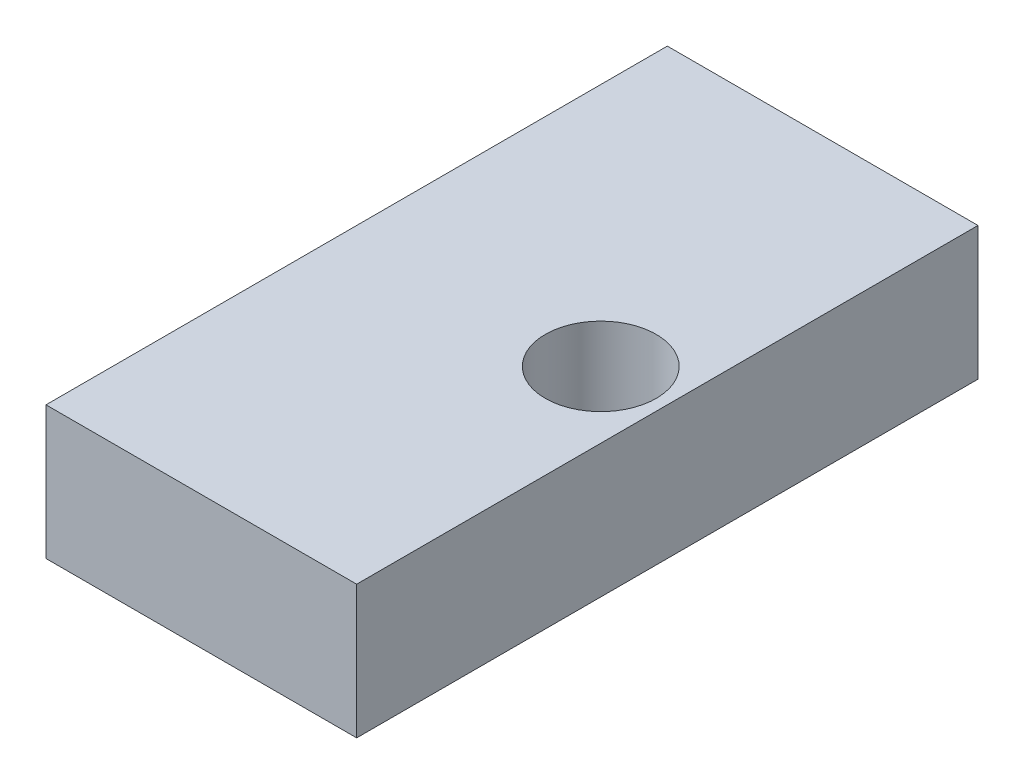
ISO-10303-21;
HEADER;
FILE_DESCRIPTION(('STEP AP214'),'2;1');
FILE_NAME('part.step','',(''),(''),'','','');
FILE_SCHEMA(('AUTOMOTIVE_DESIGN { 1 0 10303 214 1 1 1 1 }'));
ENDSEC;
DATA;
#1=APPLICATION_CONTEXT('core data for automotive mechanical design processes');
#2=APPLICATION_PROTOCOL_DEFINITION('international standard','automotive_design',2000,#1);
#3=PRODUCT_CONTEXT('',#1,'mechanical');
#4=PRODUCT('Part','Part','',(#3));
#5=PRODUCT_RELATED_PRODUCT_CATEGORY('part','',(#4));
#6=PRODUCT_DEFINITION_FORMATION('','',#4);
#7=PRODUCT_DEFINITION_CONTEXT('part definition',#1,'design');
#8=PRODUCT_DEFINITION('design','',#6,#7);
#9=PRODUCT_DEFINITION_SHAPE('','',#8);
#10=(LENGTH_UNIT() NAMED_UNIT(*) SI_UNIT(.MILLI.,.METRE.));
#11=(NAMED_UNIT(*) PLANE_ANGLE_UNIT() SI_UNIT($,.RADIAN.));
#12=(NAMED_UNIT(*) SI_UNIT($,.STERADIAN.) SOLID_ANGLE_UNIT());
#13=UNCERTAINTY_MEASURE_WITH_UNIT(LENGTH_MEASURE(1.E-05),#10,'distance_accuracy_value','');
#14=(GEOMETRIC_REPRESENTATION_CONTEXT(3) GLOBAL_UNCERTAINTY_ASSIGNED_CONTEXT((#13)) GLOBAL_UNIT_ASSIGNED_CONTEXT((#10,
#11,#12)) REPRESENTATION_CONTEXT('',''));
#15=CARTESIAN_POINT('',(0.,0.,0.));
#16=DIRECTION('',(0.,0.,1.));
#17=DIRECTION('',(1.,0.,0.));
#18=AXIS2_PLACEMENT_3D('',#15,#16,#17);
#19=CARTESIAN_POINT('',(22.225,9.525,-88.9));
#20=DIRECTION('',(1.,0.,0.));
#21=DIRECTION('',(0.,1.,0.));
#22=AXIS2_PLACEMENT_3D('',#19,#20,#21);
#23=PLANE('',#22);
#24=DIRECTION('',(0.,1.,0.));
#25=VECTOR('',#24,1.);
#26=CARTESIAN_POINT('',(22.225,9.525,0.));
#27=LINE('',#26,#25);
#28=CARTESIAN_POINT('',(22.225,-9.525,0.));
#29=VERTEX_POINT('',#28);
#30=CARTESIAN_POINT('',(22.225,9.525,0.));
#31=VERTEX_POINT('',#30);
#32=EDGE_CURVE('E98',#29,#31,#27,.T.);
#33=ORIENTED_EDGE('',*,*,#32,.F.);
#34=DIRECTION('',(0.,0.,1.));
#35=VECTOR('',#34,1.);
#36=CARTESIAN_POINT('',(22.225,-9.525,-88.9));
#37=LINE('',#36,#35);
#38=CARTESIAN_POINT('',(22.225,-9.525,-88.9));
#39=VERTEX_POINT('',#38);
#40=EDGE_CURVE('E11',#39,#29,#37,.T.);
#41=ORIENTED_EDGE('',*,*,#40,.F.);
#42=DIRECTION('',(0.,1.,0.));
#43=VECTOR('',#42,1.);
#44=CARTESIAN_POINT('',(22.225,9.525,-88.9));
#45=LINE('',#44,#43);
#46=CARTESIAN_POINT('',(22.225,9.525,-88.9));
#47=VERTEX_POINT('',#46);
#48=EDGE_CURVE('E91',#39,#47,#45,.T.);
#49=ORIENTED_EDGE('',*,*,#48,.T.);
#50=DIRECTION('',(0.,0.,1.));
#51=VECTOR('',#50,1.);
#52=CARTESIAN_POINT('',(22.225,9.525,-88.9));
#53=LINE('',#52,#51);
#54=EDGE_CURVE('E36',#47,#31,#53,.T.);
#55=ORIENTED_EDGE('',*,*,#54,.T.);
#56=EDGE_LOOP('',(#33,#41,#49,#55));
#57=FACE_BOUND('',#56,.T.);
#58=ADVANCED_FACE('F33',(#57),#23,.T.);
#59=CARTESIAN_POINT('',(-22.225,-9.525,-88.9));
#60=DIRECTION('',(0.,-1.,0.));
#61=DIRECTION('',(0.,0.,-1.));
#62=AXIS2_PLACEMENT_3D('',#59,#60,#61);
#63=PLANE('',#62);
#64=CARTESIAN_POINT('',(12.7000000000001,-9.525,-44.4499999999999));
#65=DIRECTION('',(0.,1.,0.));
#66=DIRECTION('',(0.,0.,1.));
#67=AXIS2_PLACEMENT_3D('',#64,#65,#66);
#68=CIRCLE('',#67,7.9375);
#69=CARTESIAN_POINT('',(12.7000000000001,-9.525,-36.5124999999999));
#70=VERTEX_POINT('',#69);
#71=EDGE_CURVE('E102',#70,#70,#68,.T.);
#72=ORIENTED_EDGE('',*,*,#71,.T.);
#73=EDGE_LOOP('',(#72));
#74=FACE_BOUND('',#73,.T.);
#75=DIRECTION('',(1.,0.,0.));
#76=VECTOR('',#75,1.);
#77=CARTESIAN_POINT('',(-22.225,-9.525,0.));
#78=LINE('',#77,#76);
#79=CARTESIAN_POINT('',(-22.225,-9.525,0.));
#80=VERTEX_POINT('',#79);
#81=EDGE_CURVE('E93',#80,#29,#78,.T.);
#82=ORIENTED_EDGE('',*,*,#81,.F.);
#83=DIRECTION('',(0.,0.,1.));
#84=VECTOR('',#83,1.);
#85=CARTESIAN_POINT('',(-22.225,-9.525,-88.9));
#86=LINE('',#85,#84);
#87=CARTESIAN_POINT('',(-22.225,-9.525,-88.9));
#88=VERTEX_POINT('',#87);
#89=EDGE_CURVE('E42',#88,#80,#86,.T.);
#90=ORIENTED_EDGE('',*,*,#89,.F.);
#91=DIRECTION('',(1.,0.,0.));
#92=VECTOR('',#91,1.);
#93=CARTESIAN_POINT('',(-22.225,-9.525,-88.9));
#94=LINE('',#93,#92);
#95=EDGE_CURVE('E88',#88,#39,#94,.T.);
#96=ORIENTED_EDGE('',*,*,#95,.T.);
#97=ORIENTED_EDGE('',*,*,#40,.T.);
#98=EDGE_LOOP('',(#82,#90,#96,#97));
#99=FACE_BOUND('',#98,.T.);
#100=ADVANCED_FACE('F109',(#74,#99),#63,.T.);
#101=CARTESIAN_POINT('',(-22.225,9.525,-88.9));
#102=DIRECTION('',(-1.,0.,0.));
#103=DIRECTION('',(0.,0.,1.));
#104=AXIS2_PLACEMENT_3D('',#101,#102,#103);
#105=PLANE('',#104);
#106=DIRECTION('',(0.,-1.,0.));
#107=VECTOR('',#106,1.);
#108=CARTESIAN_POINT('',(-22.225,9.525,0.));
#109=LINE('',#108,#107);
#110=CARTESIAN_POINT('',(-22.225,9.525,0.));
#111=VERTEX_POINT('',#110);
#112=EDGE_CURVE('E83',#111,#80,#109,.T.);
#113=ORIENTED_EDGE('',*,*,#112,.F.);
#114=DIRECTION('',(0.,0.,1.));
#115=VECTOR('',#114,1.);
#116=CARTESIAN_POINT('',(-22.225,9.525,-88.9));
#117=LINE('',#116,#115);
#118=CARTESIAN_POINT('',(-22.225,9.525,-88.9));
#119=VERTEX_POINT('',#118);
#120=EDGE_CURVE('E78',#119,#111,#117,.T.);
#121=ORIENTED_EDGE('',*,*,#120,.F.);
#122=DIRECTION('',(0.,-1.,0.));
#123=VECTOR('',#122,1.);
#124=CARTESIAN_POINT('',(-22.225,9.525,-88.9));
#125=LINE('',#124,#123);
#126=EDGE_CURVE('E81',#119,#88,#125,.T.);
#127=ORIENTED_EDGE('',*,*,#126,.T.);
#128=ORIENTED_EDGE('',*,*,#89,.T.);
#129=EDGE_LOOP('',(#113,#121,#127,#128));
#130=FACE_BOUND('',#129,.T.);
#131=ADVANCED_FACE('F80',(#130),#105,.T.);
#132=CARTESIAN_POINT('',(-22.225,9.525,-88.9));
#133=DIRECTION('',(0.,1.,0.));
#134=DIRECTION('',(0.,0.,1.));
#135=AXIS2_PLACEMENT_3D('',#132,#133,#134);
#136=PLANE('',#135);
#137=CARTESIAN_POINT('',(12.7000000000001,9.525,-44.4499999999999));
#138=DIRECTION('',(0.,1.,0.));
#139=DIRECTION('',(0.,0.,1.));
#140=AXIS2_PLACEMENT_3D('',#137,#138,#139);
#141=CIRCLE('',#140,7.9375);
#142=CARTESIAN_POINT('',(12.7000000000001,9.525,-36.5124999999999));
#143=VERTEX_POINT('',#142);
#144=EDGE_CURVE('E130',#143,#143,#141,.T.);
#145=ORIENTED_EDGE('',*,*,#144,.F.);
#146=EDGE_LOOP('',(#145));
#147=FACE_BOUND('',#146,.T.);
#148=DIRECTION('',(-1.,0.,0.));
#149=VECTOR('',#148,1.);
#150=CARTESIAN_POINT('',(-22.225,9.525,0.));
#151=LINE('',#150,#149);
#152=EDGE_CURVE('E101',#31,#111,#151,.T.);
#153=ORIENTED_EDGE('',*,*,#152,.F.);
#154=ORIENTED_EDGE('',*,*,#54,.F.);
#155=DIRECTION('',(-1.,0.,0.));
#156=VECTOR('',#155,1.);
#157=CARTESIAN_POINT('',(-22.225,9.525,-88.9));
#158=LINE('',#157,#156);
#159=EDGE_CURVE('E87',#47,#119,#158,.T.);
#160=ORIENTED_EDGE('',*,*,#159,.T.);
#161=ORIENTED_EDGE('',*,*,#120,.T.);
#162=EDGE_LOOP('',(#153,#154,#160,#161));
#163=FACE_BOUND('',#162,.T.);
#164=ADVANCED_FACE('F90',(#147,#163),#136,.T.);
#165=CARTESIAN_POINT('',(0.,0.,-88.9));
#166=DIRECTION('',(0.,0.,1.));
#167=DIRECTION('',(1.,0.,0.));
#168=AXIS2_PLACEMENT_3D('',#165,#166,#167);
#169=PLANE('',#168);
#170=ORIENTED_EDGE('',*,*,#48,.F.);
#171=ORIENTED_EDGE('',*,*,#95,.F.);
#172=ORIENTED_EDGE('',*,*,#126,.F.);
#173=ORIENTED_EDGE('',*,*,#159,.F.);
#174=EDGE_LOOP('',(#170,#171,#172,#173));
#175=FACE_BOUND('',#174,.T.);
#176=ADVANCED_FACE('F86',(#175),#169,.F.);
#177=CARTESIAN_POINT('',(0.,0.,0.));
#178=DIRECTION('',(0.,0.,1.));
#179=DIRECTION('',(1.,0.,0.));
#180=AXIS2_PLACEMENT_3D('',#177,#178,#179);
#181=PLANE('',#180);
#182=ORIENTED_EDGE('',*,*,#32,.T.);
#183=ORIENTED_EDGE('',*,*,#152,.T.);
#184=ORIENTED_EDGE('',*,*,#112,.T.);
#185=ORIENTED_EDGE('',*,*,#81,.T.);
#186=EDGE_LOOP('',(#182,#183,#184,#185));
#187=FACE_BOUND('',#186,.T.);
#188=ADVANCED_FACE('F108',(#187),#181,.T.);
#189=CARTESIAN_POINT('',(12.7000000000001,-9.525,-44.4499999999999));
#190=DIRECTION('',(0.,1.,0.));
#191=DIRECTION('',(0.,0.,1.));
#192=AXIS2_PLACEMENT_3D('',#189,#190,#191);
#193=CYLINDRICAL_SURFACE('',#192,7.9375);
#194=ORIENTED_EDGE('',*,*,#71,.F.);
#195=EDGE_LOOP('',(#194));
#196=FACE_BOUND('',#195,.T.);
#197=ORIENTED_EDGE('',*,*,#144,.T.);
#198=EDGE_LOOP('',(#197));
#199=FACE_BOUND('',#198,.T.);
#200=ADVANCED_FACE('F135',(#196,#199),#193,.F.);
#201=CLOSED_SHELL('',(#58,#100,#131,#164,#176,#188,#200));
#202=MANIFOLD_SOLID_BREP('B2',#201);
#203=ADVANCED_BREP_SHAPE_REPRESENTATION('',(#18,#202),#14);
#204=SHAPE_DEFINITION_REPRESENTATION(#9,#203);
ENDSEC;
END-ISO-10303-21;
